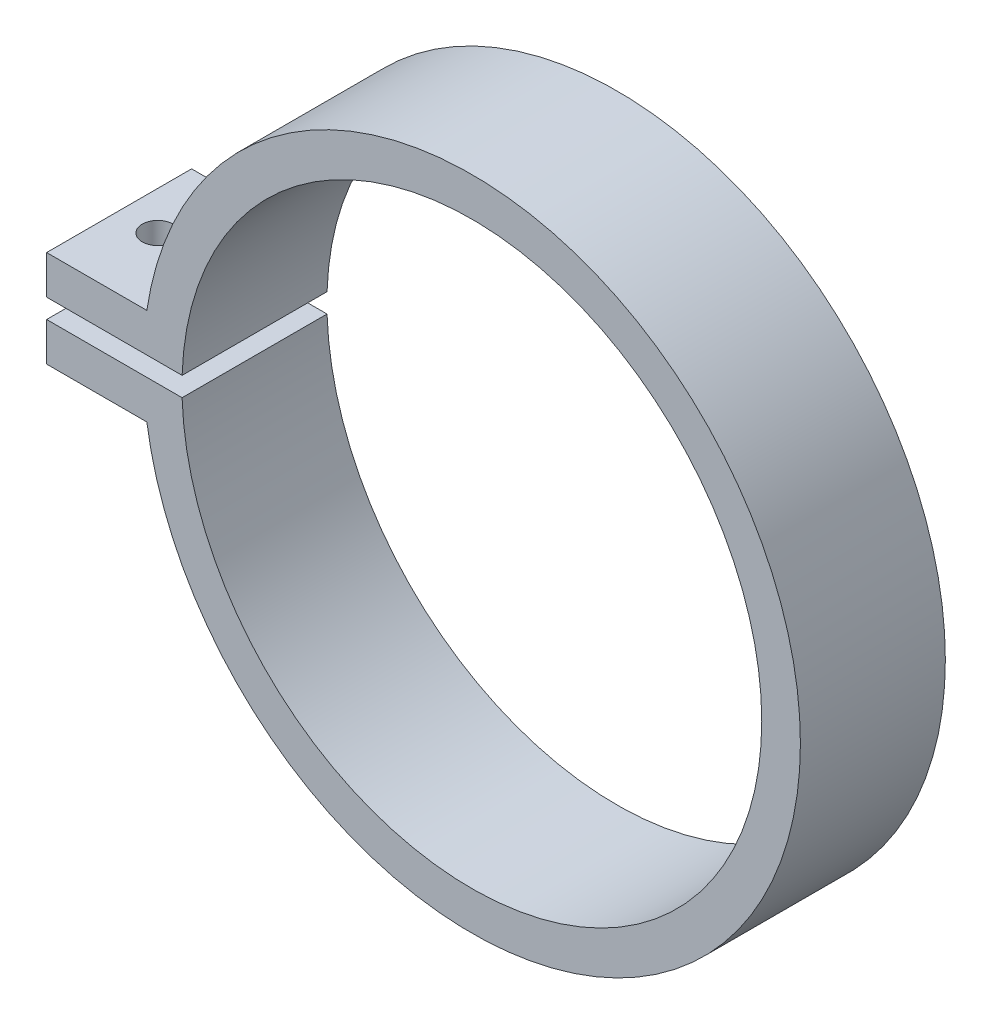
ISO-10303-21;
HEADER;
FILE_DESCRIPTION(('STEP AP214'),'2;1');
FILE_NAME('part.step','',(''),(''),'','','');
FILE_SCHEMA(('AUTOMOTIVE_DESIGN { 1 0 10303 214 1 1 1 1 }'));
ENDSEC;
DATA;
#1=APPLICATION_CONTEXT('core data for automotive mechanical design processes');
#2=APPLICATION_PROTOCOL_DEFINITION('international standard','automotive_design',2000,#1);
#3=PRODUCT_CONTEXT('',#1,'mechanical');
#4=PRODUCT('Part','Part','',(#3));
#5=PRODUCT_RELATED_PRODUCT_CATEGORY('part','',(#4));
#6=PRODUCT_DEFINITION_FORMATION('','',#4);
#7=PRODUCT_DEFINITION_CONTEXT('part definition',#1,'design');
#8=PRODUCT_DEFINITION('design','',#6,#7);
#9=PRODUCT_DEFINITION_SHAPE('','',#8);
#10=(LENGTH_UNIT() NAMED_UNIT(*) SI_UNIT(.MILLI.,.METRE.));
#11=(NAMED_UNIT(*) PLANE_ANGLE_UNIT() SI_UNIT($,.RADIAN.));
#12=(NAMED_UNIT(*) SI_UNIT($,.STERADIAN.) SOLID_ANGLE_UNIT());
#13=UNCERTAINTY_MEASURE_WITH_UNIT(LENGTH_MEASURE(1.E-05),#10,'distance_accuracy_value','');
#14=(GEOMETRIC_REPRESENTATION_CONTEXT(3) GLOBAL_UNCERTAINTY_ASSIGNED_CONTEXT((#13)) GLOBAL_UNIT_ASSIGNED_CONTEXT((#10,
#11,#12)) REPRESENTATION_CONTEXT('',''));
#15=CARTESIAN_POINT('',(0.,0.,0.));
#16=DIRECTION('',(0.,0.,1.));
#17=DIRECTION('',(1.,0.,0.));
#18=AXIS2_PLACEMENT_3D('',#15,#16,#17);
#19=CARTESIAN_POINT('',(0.,0.,7.5));
#20=DIRECTION('',(0.,0.,1.));
#21=DIRECTION('',(1.,0.,0.));
#22=AXIS2_PLACEMENT_3D('',#19,#20,#21);
#23=PLANE('',#22);
#24=DIRECTION('',(0.,-1.,0.));
#25=VECTOR('',#24,1.);
#26=CARTESIAN_POINT('',(-44.,5.,7.5));
#27=LINE('',#26,#25);
#28=CARTESIAN_POINT('',(-44.,5.,7.5));
#29=VERTEX_POINT('',#28);
#30=CARTESIAN_POINT('',(-44.,0.999999999999997,7.5));
#31=VERTEX_POINT('',#30);
#32=EDGE_CURVE('E139',#29,#31,#27,.T.);
#33=ORIENTED_EDGE('',*,*,#32,.T.);
#34=DIRECTION('',(1.,0.,0.));
#35=VECTOR('',#34,1.);
#36=CARTESIAN_POINT('',(-44.,0.999999999999997,7.5));
#37=LINE('',#36,#35);
#38=CARTESIAN_POINT('',(-29.9833287011299,0.999999999999998,7.5));
#39=VERTEX_POINT('',#38);
#40=EDGE_CURVE('E123',#31,#39,#37,.T.);
#41=ORIENTED_EDGE('',*,*,#40,.T.);
#42=CARTESIAN_POINT('',(0.,0.,7.5));
#43=DIRECTION('',(0.,0.,1.));
#44=DIRECTION('',(1.,0.,0.));
#45=AXIS2_PLACEMENT_3D('',#42,#43,#44);
#46=CIRCLE('',#45,30.);
#47=CARTESIAN_POINT('',(-29.9833287011299,-1.,7.5));
#48=VERTEX_POINT('',#47);
#49=EDGE_CURVE('E131',#48,#39,#46,.T.);
#50=ORIENTED_EDGE('',*,*,#49,.F.);
#51=DIRECTION('',(1.,0.,0.));
#52=VECTOR('',#51,1.);
#53=CARTESIAN_POINT('',(-44.,-1.,7.5));
#54=LINE('',#53,#52);
#55=CARTESIAN_POINT('',(-44.,-1.,7.5));
#56=VERTEX_POINT('',#55);
#57=EDGE_CURVE('E140',#56,#48,#54,.T.);
#58=ORIENTED_EDGE('',*,*,#57,.F.);
#59=CARTESIAN_POINT('',(-44.,-5.,7.5));
#60=VERTEX_POINT('',#59);
#61=EDGE_CURVE('E151',#56,#60,#27,.T.);
#62=ORIENTED_EDGE('',*,*,#61,.T.);
#63=DIRECTION('',(1.,0.,0.));
#64=VECTOR('',#63,1.);
#65=CARTESIAN_POINT('',(-44.,-5.,7.5));
#66=LINE('',#65,#64);
#67=CARTESIAN_POINT('',(-33.6303434416005,-5.,7.5));
#68=VERTEX_POINT('',#67);
#69=EDGE_CURVE('E154',#60,#68,#66,.T.);
#70=ORIENTED_EDGE('',*,*,#69,.T.);
#71=CARTESIAN_POINT('',(0.,0.,7.5));
#72=DIRECTION('',(0.,0.,1.));
#73=DIRECTION('',(1.,0.,0.));
#74=AXIS2_PLACEMENT_3D('',#71,#72,#73);
#75=CIRCLE('',#74,34.);
#76=CARTESIAN_POINT('',(-33.6303434416005,5.,7.5));
#77=VERTEX_POINT('',#76);
#78=EDGE_CURVE('E76',#68,#77,#75,.T.);
#79=ORIENTED_EDGE('',*,*,#78,.T.);
#80=DIRECTION('',(-1.,0.,0.));
#81=VECTOR('',#80,1.);
#82=CARTESIAN_POINT('',(-44.,5.,7.5));
#83=LINE('',#82,#81);
#84=EDGE_CURVE('E149',#77,#29,#83,.T.);
#85=ORIENTED_EDGE('',*,*,#84,.T.);
#86=EDGE_LOOP('',(#33,#41,#50,#58,#62,#70,#79,#85));
#87=FACE_BOUND('',#86,.T.);
#88=ADVANCED_FACE('F52',(#87),#23,.T.);
#89=CARTESIAN_POINT('',(0.,0.,-7.5));
#90=DIRECTION('',(0.,0.,1.));
#91=DIRECTION('',(1.,0.,0.));
#92=AXIS2_PLACEMENT_3D('',#89,#90,#91);
#93=PLANE('',#92);
#94=DIRECTION('',(1.,0.,0.));
#95=VECTOR('',#94,1.);
#96=CARTESIAN_POINT('',(0.,1.,-7.5));
#97=LINE('',#96,#95);
#98=CARTESIAN_POINT('',(-44.,0.999999999999997,-7.5));
#99=VERTEX_POINT('',#98);
#100=CARTESIAN_POINT('',(-29.9833287011299,0.999999999999998,-7.5));
#101=VERTEX_POINT('',#100);
#102=EDGE_CURVE('E126',#99,#101,#97,.T.);
#103=ORIENTED_EDGE('',*,*,#102,.F.);
#104=DIRECTION('',(0.,-1.,0.));
#105=VECTOR('',#104,1.);
#106=CARTESIAN_POINT('',(-44.,5.,-7.5));
#107=LINE('',#106,#105);
#108=CARTESIAN_POINT('',(-44.,5.,-7.5));
#109=VERTEX_POINT('',#108);
#110=EDGE_CURVE('E160',#109,#99,#107,.T.);
#111=ORIENTED_EDGE('',*,*,#110,.F.);
#112=DIRECTION('',(-1.,0.,0.));
#113=VECTOR('',#112,1.);
#114=CARTESIAN_POINT('',(-44.,5.,-7.5));
#115=LINE('',#114,#113);
#116=CARTESIAN_POINT('',(-33.6303434416005,5.,-7.5));
#117=VERTEX_POINT('',#116);
#118=EDGE_CURVE('E148',#117,#109,#115,.T.);
#119=ORIENTED_EDGE('',*,*,#118,.F.);
#120=CARTESIAN_POINT('',(0.,0.,-7.5));
#121=DIRECTION('',(0.,0.,1.));
#122=DIRECTION('',(1.,0.,0.));
#123=AXIS2_PLACEMENT_3D('',#120,#121,#122);
#124=CIRCLE('',#123,34.);
#125=CARTESIAN_POINT('',(-33.6303434416005,-5.,-7.5));
#126=VERTEX_POINT('',#125);
#127=EDGE_CURVE('E175',#126,#117,#124,.T.);
#128=ORIENTED_EDGE('',*,*,#127,.F.);
#129=DIRECTION('',(1.,0.,0.));
#130=VECTOR('',#129,1.);
#131=CARTESIAN_POINT('',(-44.,-5.,-7.5));
#132=LINE('',#131,#130);
#133=CARTESIAN_POINT('',(-44.,-5.,-7.5));
#134=VERTEX_POINT('',#133);
#135=EDGE_CURVE('E152',#134,#126,#132,.T.);
#136=ORIENTED_EDGE('',*,*,#135,.F.);
#137=CARTESIAN_POINT('',(-44.,-1.,-7.5));
#138=VERTEX_POINT('',#137);
#139=EDGE_CURVE('E159',#138,#134,#107,.T.);
#140=ORIENTED_EDGE('',*,*,#139,.F.);
#141=DIRECTION('',(1.,0.,0.));
#142=VECTOR('',#141,1.);
#143=CARTESIAN_POINT('',(0.,-1.,-7.5));
#144=LINE('',#143,#142);
#145=CARTESIAN_POINT('',(-29.9833287011299,-1.,-7.5));
#146=VERTEX_POINT('',#145);
#147=EDGE_CURVE('E68',#138,#146,#144,.T.);
#148=ORIENTED_EDGE('',*,*,#147,.T.);
#149=CARTESIAN_POINT('',(0.,0.,-7.5));
#150=DIRECTION('',(0.,0.,1.));
#151=DIRECTION('',(1.,0.,0.));
#152=AXIS2_PLACEMENT_3D('',#149,#150,#151);
#153=CIRCLE('',#152,30.);
#154=EDGE_CURVE('E12',#146,#101,#153,.T.);
#155=ORIENTED_EDGE('',*,*,#154,.T.);
#156=EDGE_LOOP('',(#103,#111,#119,#128,#136,#140,#148,#155));
#157=FACE_BOUND('',#156,.T.);
#158=ADVANCED_FACE('F183',(#157),#93,.F.);
#159=CARTESIAN_POINT('',(-44.,5.,7.5));
#160=DIRECTION('',(1.,0.,0.));
#161=DIRECTION('',(0.,0.,-1.));
#162=AXIS2_PLACEMENT_3D('',#159,#160,#161);
#163=PLANE('',#162);
#164=DIRECTION('',(0.,0.,-1.));
#165=VECTOR('',#164,1.);
#166=CARTESIAN_POINT('',(-44.,0.999999999999997,7.5));
#167=LINE('',#166,#165);
#168=EDGE_CURVE('E61',#31,#99,#167,.T.);
#169=ORIENTED_EDGE('',*,*,#168,.F.);
#170=ORIENTED_EDGE('',*,*,#32,.F.);
#171=DIRECTION('',(0.,0.,-1.));
#172=VECTOR('',#171,1.);
#173=CARTESIAN_POINT('',(-44.,5.,7.5));
#174=LINE('',#173,#172);
#175=EDGE_CURVE('E167',#29,#109,#174,.T.);
#176=ORIENTED_EDGE('',*,*,#175,.T.);
#177=ORIENTED_EDGE('',*,*,#110,.T.);
#178=EDGE_LOOP('',(#169,#170,#176,#177));
#179=FACE_BOUND('',#178,.T.);
#180=ADVANCED_FACE('F185',(#179),#163,.F.);
#181=CARTESIAN_POINT('',(0.,0.,7.5));
#182=DIRECTION('',(0.,0.,-1.));
#183=DIRECTION('',(-1.,0.,0.));
#184=AXIS2_PLACEMENT_3D('',#181,#182,#183);
#185=CYLINDRICAL_SURFACE('',#184,34.);
#186=DIRECTION('',(0.,0.,-1.));
#187=VECTOR('',#186,1.);
#188=CARTESIAN_POINT('',(-33.6303434416005,5.,7.5));
#189=LINE('',#188,#187);
#190=EDGE_CURVE('E172',#77,#117,#189,.T.);
#191=ORIENTED_EDGE('',*,*,#190,.F.);
#192=ORIENTED_EDGE('',*,*,#78,.F.);
#193=DIRECTION('',(0.,0.,-1.));
#194=VECTOR('',#193,1.);
#195=CARTESIAN_POINT('',(-33.6303434416005,-5.,7.5));
#196=LINE('',#195,#194);
#197=EDGE_CURVE('E170',#126,#68,#196,.F.);
#198=ORIENTED_EDGE('',*,*,#197,.F.);
#199=ORIENTED_EDGE('',*,*,#127,.T.);
#200=EDGE_LOOP('',(#191,#192,#198,#199));
#201=FACE_BOUND('',#200,.T.);
#202=ADVANCED_FACE('F54',(#201),#185,.T.);
#203=CARTESIAN_POINT('',(-44.,5.,7.5));
#204=DIRECTION('',(0.,-1.,0.));
#205=DIRECTION('',(1.,0.,0.));
#206=AXIS2_PLACEMENT_3D('',#203,#204,#205);
#207=PLANE('',#206);
#208=CARTESIAN_POINT('',(-40.,5.,0.));
#209=DIRECTION('',(0.,-1.,0.));
#210=DIRECTION('',(1.,0.,0.));
#211=AXIS2_PLACEMENT_3D('',#208,#209,#210);
#212=CIRCLE('',#211,1.60000000000001);
#213=CARTESIAN_POINT('',(-38.4,5.,0.));
#214=VERTEX_POINT('',#213);
#215=EDGE_CURVE('E142',#214,#214,#212,.T.);
#216=ORIENTED_EDGE('',*,*,#215,.T.);
#217=EDGE_LOOP('',(#216));
#218=FACE_BOUND('',#217,.T.);
#219=ORIENTED_EDGE('',*,*,#84,.F.);
#220=ORIENTED_EDGE('',*,*,#190,.T.);
#221=ORIENTED_EDGE('',*,*,#118,.T.);
#222=ORIENTED_EDGE('',*,*,#175,.F.);
#223=EDGE_LOOP('',(#219,#220,#221,#222));
#224=FACE_BOUND('',#223,.T.);
#225=ADVANCED_FACE('F189',(#218,#224),#207,.F.);
#226=CARTESIAN_POINT('',(-44.,-5.,7.5));
#227=DIRECTION('',(0.,1.,0.));
#228=DIRECTION('',(-1.,0.,0.));
#229=AXIS2_PLACEMENT_3D('',#226,#227,#228);
#230=PLANE('',#229);
#231=CARTESIAN_POINT('',(-40.,-5.,0.));
#232=DIRECTION('',(0.,1.,0.));
#233=DIRECTION('',(-1.,0.,0.));
#234=AXIS2_PLACEMENT_3D('',#231,#232,#233);
#235=CIRCLE('',#234,1.60000000000001);
#236=CARTESIAN_POINT('',(-41.6,-5.,0.));
#237=VERTEX_POINT('',#236);
#238=EDGE_CURVE('E231',#237,#237,#235,.F.);
#239=ORIENTED_EDGE('',*,*,#238,.F.);
#240=EDGE_LOOP('',(#239));
#241=FACE_BOUND('',#240,.T.);
#242=ORIENTED_EDGE('',*,*,#135,.T.);
#243=ORIENTED_EDGE('',*,*,#197,.T.);
#244=ORIENTED_EDGE('',*,*,#69,.F.);
#245=DIRECTION('',(0.,0.,-1.));
#246=VECTOR('',#245,1.);
#247=CARTESIAN_POINT('',(-44.,-5.,7.5));
#248=LINE('',#247,#246);
#249=EDGE_CURVE('E157',#60,#134,#248,.T.);
#250=ORIENTED_EDGE('',*,*,#249,.T.);
#251=EDGE_LOOP('',(#242,#243,#244,#250));
#252=FACE_BOUND('',#251,.T.);
#253=ADVANCED_FACE('F194',(#241,#252),#230,.F.);
#254=ORIENTED_EDGE('',*,*,#61,.F.);
#255=DIRECTION('',(0.,0.,-1.));
#256=VECTOR('',#255,1.);
#257=CARTESIAN_POINT('',(-44.,-1.,7.5));
#258=LINE('',#257,#256);
#259=EDGE_CURVE('E177',#56,#138,#258,.T.);
#260=ORIENTED_EDGE('',*,*,#259,.T.);
#261=ORIENTED_EDGE('',*,*,#139,.T.);
#262=ORIENTED_EDGE('',*,*,#249,.F.);
#263=EDGE_LOOP('',(#254,#260,#261,#262));
#264=FACE_BOUND('',#263,.T.);
#265=ADVANCED_FACE('F198',(#264),#163,.F.);
#266=CARTESIAN_POINT('',(0.,0.,-19.));
#267=DIRECTION('',(0.,0.,1.));
#268=DIRECTION('',(1.,0.,0.));
#269=AXIS2_PLACEMENT_3D('',#266,#267,#268);
#270=CYLINDRICAL_SURFACE('',#269,30.);
#271=DIRECTION('',(0.,0.,1.));
#272=VECTOR('',#271,1.);
#273=CARTESIAN_POINT('',(-29.9833287011299,-1.,-19.));
#274=LINE('',#273,#272);
#275=EDGE_CURVE('E128',#146,#48,#274,.T.);
#276=ORIENTED_EDGE('',*,*,#275,.T.);
#277=ORIENTED_EDGE('',*,*,#49,.T.);
#278=DIRECTION('',(0.,0.,1.));
#279=VECTOR('',#278,1.);
#280=CARTESIAN_POINT('',(-29.9833287011299,0.999999999999998,-19.));
#281=LINE('',#280,#279);
#282=EDGE_CURVE('E119',#101,#39,#281,.T.);
#283=ORIENTED_EDGE('',*,*,#282,.F.);
#284=ORIENTED_EDGE('',*,*,#154,.F.);
#285=EDGE_LOOP('',(#276,#277,#283,#284));
#286=FACE_BOUND('',#285,.T.);
#287=ADVANCED_FACE('F132',(#286),#270,.F.);
#288=CARTESIAN_POINT('',(-44.,0.999999999999997,-19.));
#289=DIRECTION('',(0.,-1.,0.));
#290=DIRECTION('',(1.,0.,0.));
#291=AXIS2_PLACEMENT_3D('',#288,#289,#290);
#292=PLANE('',#291);
#293=CARTESIAN_POINT('',(-40.,0.999999999999997,0.));
#294=DIRECTION('',(0.,-1.,0.));
#295=DIRECTION('',(1.,0.,0.));
#296=AXIS2_PLACEMENT_3D('',#293,#294,#295);
#297=CIRCLE('',#296,1.60000000000001);
#298=CARTESIAN_POINT('',(-38.4,0.999999999999997,0.));
#299=VERTEX_POINT('',#298);
#300=EDGE_CURVE('E233',#299,#299,#297,.T.);
#301=ORIENTED_EDGE('',*,*,#300,.F.);
#302=EDGE_LOOP('',(#301));
#303=FACE_BOUND('',#302,.T.);
#304=ORIENTED_EDGE('',*,*,#102,.T.);
#305=ORIENTED_EDGE('',*,*,#282,.T.);
#306=ORIENTED_EDGE('',*,*,#40,.F.);
#307=ORIENTED_EDGE('',*,*,#168,.T.);
#308=EDGE_LOOP('',(#304,#305,#306,#307));
#309=FACE_BOUND('',#308,.T.);
#310=ADVANCED_FACE('F121',(#303,#309),#292,.T.);
#311=CARTESIAN_POINT('',(-44.,-1.,-19.));
#312=DIRECTION('',(0.,-1.,0.));
#313=DIRECTION('',(1.,0.,0.));
#314=AXIS2_PLACEMENT_3D('',#311,#312,#313);
#315=PLANE('',#314);
#316=CARTESIAN_POINT('',(-40.,-1.,0.));
#317=DIRECTION('',(0.,-1.,0.));
#318=DIRECTION('',(1.,0.,0.));
#319=AXIS2_PLACEMENT_3D('',#316,#317,#318);
#320=CIRCLE('',#319,1.60000000000001);
#321=CARTESIAN_POINT('',(-38.4,-1.,0.));
#322=VERTEX_POINT('',#321);
#323=EDGE_CURVE('E56',#322,#322,#320,.T.);
#324=ORIENTED_EDGE('',*,*,#323,.T.);
#325=EDGE_LOOP('',(#324));
#326=FACE_BOUND('',#325,.T.);
#327=ORIENTED_EDGE('',*,*,#259,.F.);
#328=ORIENTED_EDGE('',*,*,#57,.T.);
#329=ORIENTED_EDGE('',*,*,#275,.F.);
#330=ORIENTED_EDGE('',*,*,#147,.F.);
#331=EDGE_LOOP('',(#327,#328,#329,#330));
#332=FACE_BOUND('',#331,.T.);
#333=ADVANCED_FACE('F199',(#326,#332),#315,.F.);
#334=CARTESIAN_POINT('',(-40.,-9.52548339959392,0.));
#335=DIRECTION('',(0.,1.,0.));
#336=DIRECTION('',(-1.,0.,0.));
#337=AXIS2_PLACEMENT_3D('',#334,#335,#336);
#338=CYLINDRICAL_SURFACE('',#337,1.60000000000001);
#339=ORIENTED_EDGE('',*,*,#238,.T.);
#340=EDGE_LOOP('',(#339));
#341=FACE_BOUND('',#340,.T.);
#342=ORIENTED_EDGE('',*,*,#323,.F.);
#343=EDGE_LOOP('',(#342));
#344=FACE_BOUND('',#343,.T.);
#345=ADVANCED_FACE('F201',(#341,#344),#338,.F.);
#346=ORIENTED_EDGE('',*,*,#300,.T.);
#347=EDGE_LOOP('',(#346));
#348=FACE_BOUND('',#347,.T.);
#349=ORIENTED_EDGE('',*,*,#215,.F.);
#350=EDGE_LOOP('',(#349));
#351=FACE_BOUND('',#350,.T.);
#352=ADVANCED_FACE('F208',(#348,#351),#338,.F.);
#353=CLOSED_SHELL('',(#88,#158,#180,#202,#225,#253,#265,#287,#310,#333,#345,#352));
#354=MANIFOLD_SOLID_BREP('B2',#353);
#355=ADVANCED_BREP_SHAPE_REPRESENTATION('',(#18,#354),#14);
#356=SHAPE_DEFINITION_REPRESENTATION(#9,#355);
ENDSEC;
END-ISO-10303-21;
